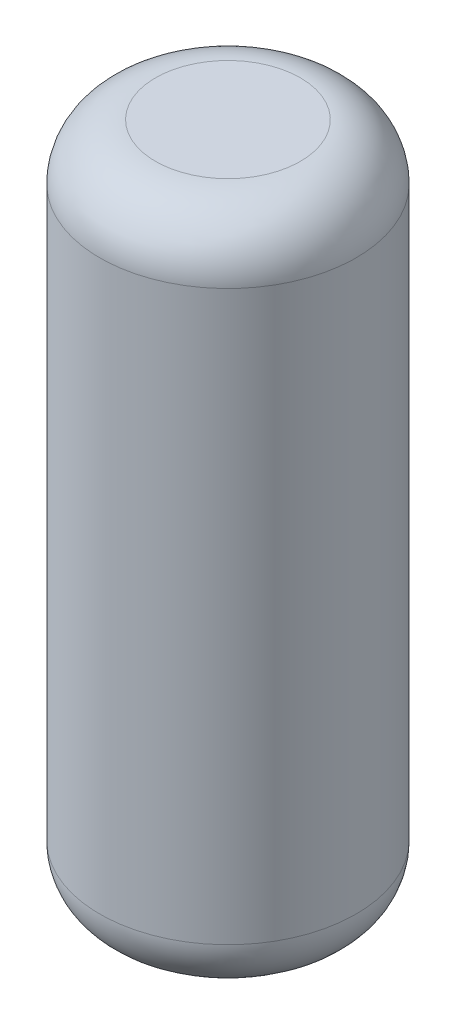
ISO-10303-21;
HEADER;
FILE_DESCRIPTION(('STEP AP214'),'2;1');
FILE_NAME('part.step','',(''),(''),'','','');
FILE_SCHEMA(('AUTOMOTIVE_DESIGN { 1 0 10303 214 1 1 1 1 }'));
ENDSEC;
DATA;
#1=APPLICATION_CONTEXT('core data for automotive mechanical design processes');
#2=APPLICATION_PROTOCOL_DEFINITION('international standard','automotive_design',2000,#1);
#3=PRODUCT_CONTEXT('',#1,'mechanical');
#4=PRODUCT('Part','Part','',(#3));
#5=PRODUCT_RELATED_PRODUCT_CATEGORY('part','',(#4));
#6=PRODUCT_DEFINITION_FORMATION('','',#4);
#7=PRODUCT_DEFINITION_CONTEXT('part definition',#1,'design');
#8=PRODUCT_DEFINITION('design','',#6,#7);
#9=PRODUCT_DEFINITION_SHAPE('','',#8);
#10=(LENGTH_UNIT() NAMED_UNIT(*) SI_UNIT(.MILLI.,.METRE.));
#11=(NAMED_UNIT(*) PLANE_ANGLE_UNIT() SI_UNIT($,.RADIAN.));
#12=(NAMED_UNIT(*) SI_UNIT($,.STERADIAN.) SOLID_ANGLE_UNIT());
#13=UNCERTAINTY_MEASURE_WITH_UNIT(LENGTH_MEASURE(1.E-05),#10,'distance_accuracy_value','');
#14=(GEOMETRIC_REPRESENTATION_CONTEXT(3) GLOBAL_UNCERTAINTY_ASSIGNED_CONTEXT((#13)) GLOBAL_UNIT_ASSIGNED_CONTEXT((#10,
#11,#12)) REPRESENTATION_CONTEXT('',''));
#15=CARTESIAN_POINT('',(0.,0.,0.));
#16=DIRECTION('',(0.,0.,1.));
#17=DIRECTION('',(1.,0.,0.));
#18=AXIS2_PLACEMENT_3D('',#15,#16,#17);
#19=CARTESIAN_POINT('',(0.,229.87,0.));
#20=DIRECTION('',(0.,1.,0.));
#21=DIRECTION('',(0.,0.,1.));
#22=AXIS2_PLACEMENT_3D('',#19,#20,#21);
#23=PLANE('',#22);
#24=CARTESIAN_POINT('',(0.,229.87,0.));
#25=DIRECTION('',(0.,-1.,0.));
#26=DIRECTION('',(0.,0.,-1.));
#27=AXIS2_PLACEMENT_3D('',#24,#25,#26);
#28=CIRCLE('',#27,49.5299999999998);
#29=CARTESIAN_POINT('',(0.,229.87,-49.5299999999998));
#30=VERTEX_POINT('',#29);
#31=EDGE_CURVE('E59',#30,#30,#28,.T.);
#32=ORIENTED_EDGE('',*,*,#31,.T.);
#33=EDGE_LOOP('',(#32));
#34=FACE_BOUND('',#33,.T.);
#35=ADVANCED_FACE('F36',(#34),#23,.F.);
#36=CARTESIAN_POINT('',(0.,194.31,0.));
#37=DIRECTION('',(0.,-1.,0.));
#38=DIRECTION('',(0.,0.,-1.));
#39=AXIS2_PLACEMENT_3D('',#36,#37,#38);
#40=TOROIDAL_SURFACE('',#39,49.53,35.56);
#41=ORIENTED_EDGE('',*,*,#31,.F.);
#42=EDGE_LOOP('',(#41));
#43=FACE_BOUND('',#42,.T.);
#44=CARTESIAN_POINT('',(0.,194.31,0.));
#45=DIRECTION('',(0.,-1.,0.));
#46=DIRECTION('',(0.,0.,-1.));
#47=AXIS2_PLACEMENT_3D('',#44,#45,#46);
#48=CIRCLE('',#47,85.09);
#49=CARTESIAN_POINT('',(0.,194.31,-85.09));
#50=VERTEX_POINT('',#49);
#51=EDGE_CURVE('E69',#50,#50,#48,.T.);
#52=ORIENTED_EDGE('',*,*,#51,.T.);
#53=EDGE_LOOP('',(#52));
#54=FACE_BOUND('',#53,.T.);
#55=ADVANCED_FACE('F112',(#43,#54),#40,.F.);
#56=CARTESIAN_POINT('',(0.,-232.41,0.));
#57=DIRECTION('',(0.,-1.,0.));
#58=DIRECTION('',(0.,0.,-1.));
#59=AXIS2_PLACEMENT_3D('',#56,#57,#58);
#60=CYLINDRICAL_SURFACE('',#59,85.09);
#61=ORIENTED_EDGE('',*,*,#51,.F.);
#62=EDGE_LOOP('',(#61));
#63=FACE_BOUND('',#62,.T.);
#64=CARTESIAN_POINT('',(0.,-194.31,0.));
#65=DIRECTION('',(0.,-1.,0.));
#66=DIRECTION('',(0.,0.,-1.));
#67=AXIS2_PLACEMENT_3D('',#64,#65,#66);
#68=CIRCLE('',#67,85.09);
#69=CARTESIAN_POINT('',(0.,-194.31,-85.09));
#70=VERTEX_POINT('',#69);
#71=EDGE_CURVE('E66',#70,#70,#68,.T.);
#72=ORIENTED_EDGE('',*,*,#71,.T.);
#73=EDGE_LOOP('',(#72));
#74=FACE_BOUND('',#73,.T.);
#75=ADVANCED_FACE('F118',(#63,#74),#60,.F.);
#76=CARTESIAN_POINT('',(0.,-194.31,0.));
#77=DIRECTION('',(0.,-1.,0.));
#78=DIRECTION('',(0.,0.,-1.));
#79=AXIS2_PLACEMENT_3D('',#76,#77,#78);
#80=TOROIDAL_SURFACE('',#79,49.53,35.56);
#81=ORIENTED_EDGE('',*,*,#71,.F.);
#82=EDGE_LOOP('',(#81));
#83=FACE_BOUND('',#82,.T.);
#84=CARTESIAN_POINT('',(0.,-229.87,0.));
#85=DIRECTION('',(0.,-1.,0.));
#86=DIRECTION('',(0.,0.,-1.));
#87=AXIS2_PLACEMENT_3D('',#84,#85,#86);
#88=CIRCLE('',#87,49.5299999999998);
#89=CARTESIAN_POINT('',(0.,-229.87,-49.5299999999998));
#90=VERTEX_POINT('',#89);
#91=EDGE_CURVE('E63',#90,#90,#88,.T.);
#92=ORIENTED_EDGE('',*,*,#91,.T.);
#93=EDGE_LOOP('',(#92));
#94=FACE_BOUND('',#93,.T.);
#95=ADVANCED_FACE('F125',(#83,#94),#80,.F.);
#96=CARTESIAN_POINT('',(0.,-229.87,0.));
#97=DIRECTION('',(0.,-1.,0.));
#98=DIRECTION('',(0.,0.,-1.));
#99=AXIS2_PLACEMENT_3D('',#96,#97,#98);
#100=PLANE('',#99);
#101=CARTESIAN_POINT('',(0.,-229.87,0.));
#102=DIRECTION('',(0.,-1.,0.));
#103=DIRECTION('',(0.,0.,-1.));
#104=AXIS2_PLACEMENT_3D('',#101,#102,#103);
#105=CIRCLE('',#104,10.16);
#106=CARTESIAN_POINT('',(0.,-229.87,10.16));
#107=VERTEX_POINT('',#106);
#108=EDGE_CURVE('E60',#107,#107,#105,.T.);
#109=ORIENTED_EDGE('',*,*,#108,.T.);
#110=EDGE_LOOP('',(#109));
#111=FACE_BOUND('',#110,.T.);
#112=ORIENTED_EDGE('',*,*,#91,.F.);
#113=EDGE_LOOP('',(#112));
#114=FACE_BOUND('',#113,.T.);
#115=ADVANCED_FACE('F129',(#111,#114),#100,.F.);
#116=CARTESIAN_POINT('',(0.,-251.46,0.));
#117=DIRECTION('',(0.,1.,0.));
#118=DIRECTION('',(0.,0.,1.));
#119=AXIS2_PLACEMENT_3D('',#116,#117,#118);
#120=CYLINDRICAL_SURFACE('',#119,10.16);
#121=CARTESIAN_POINT('',(0.,-232.41,0.));
#122=DIRECTION('',(0.,-1.,0.));
#123=DIRECTION('',(0.,0.,-1.));
#124=AXIS2_PLACEMENT_3D('',#121,#122,#123);
#125=CIRCLE('',#124,10.16);
#126=CARTESIAN_POINT('',(0.,-232.41,10.16));
#127=VERTEX_POINT('',#126);
#128=EDGE_CURVE('E40',#127,#127,#125,.T.);
#129=CARTESIAN_POINT('',(0.,-229.87,10.16));
#130=CARTESIAN_POINT('',(0.,-229.896458333333,10.16));
#131=CARTESIAN_POINT('',(0.,-229.922916666667,10.16));
#132=CARTESIAN_POINT('',(0.,-229.975833333333,10.16));
#133=CARTESIAN_POINT('',(0.,-230.002291666667,10.16));
#134=CARTESIAN_POINT('',(0.,-230.055208333333,10.16));
#135=CARTESIAN_POINT('',(0.,-230.081666666667,10.16));
#136=CARTESIAN_POINT('',(0.,-230.134583333333,10.16));
#137=CARTESIAN_POINT('',(0.,-230.161041666667,10.16));
#138=CARTESIAN_POINT('',(0.,-230.213958333333,10.16));
#139=CARTESIAN_POINT('',(0.,-230.240416666667,10.16));
#140=CARTESIAN_POINT('',(0.,-230.293333333333,10.16));
#141=CARTESIAN_POINT('',(0.,-230.319791666667,10.16));
#142=CARTESIAN_POINT('',(0.,-230.372708333333,10.16));
#143=CARTESIAN_POINT('',(0.,-230.399166666667,10.16));
#144=CARTESIAN_POINT('',(0.,-230.452083333333,10.16));
#145=CARTESIAN_POINT('',(0.,-230.478541666667,10.16));
#146=CARTESIAN_POINT('',(0.,-230.531458333333,10.16));
#147=CARTESIAN_POINT('',(0.,-230.557916666667,10.16));
#148=CARTESIAN_POINT('',(0.,-230.610833333333,10.16));
#149=CARTESIAN_POINT('',(0.,-230.637291666667,10.16));
#150=CARTESIAN_POINT('',(0.,-230.690208333333,10.16));
#151=CARTESIAN_POINT('',(0.,-230.716666666667,10.16));
#152=CARTESIAN_POINT('',(0.,-230.769583333333,10.16));
#153=CARTESIAN_POINT('',(0.,-230.796041666667,10.16));
#154=CARTESIAN_POINT('',(0.,-230.848958333333,10.16));
#155=CARTESIAN_POINT('',(0.,-230.875416666667,10.16));
#156=CARTESIAN_POINT('',(0.,-230.928333333333,10.16));
#157=CARTESIAN_POINT('',(0.,-230.954791666667,10.16));
#158=CARTESIAN_POINT('',(0.,-231.007708333333,10.16));
#159=CARTESIAN_POINT('',(0.,-231.034166666667,10.16));
#160=CARTESIAN_POINT('',(0.,-231.087083333333,10.16));
#161=CARTESIAN_POINT('',(0.,-231.113541666667,10.16));
#162=CARTESIAN_POINT('',(0.,-231.166458333333,10.16));
#163=CARTESIAN_POINT('',(0.,-231.192916666667,10.16));
#164=CARTESIAN_POINT('',(0.,-231.245833333333,10.16));
#165=CARTESIAN_POINT('',(0.,-231.272291666667,10.16));
#166=CARTESIAN_POINT('',(0.,-231.325208333333,10.16));
#167=CARTESIAN_POINT('',(0.,-231.351666666667,10.16));
#168=CARTESIAN_POINT('',(0.,-231.404583333333,10.16));
#169=CARTESIAN_POINT('',(0.,-231.431041666667,10.16));
#170=CARTESIAN_POINT('',(0.,-231.483958333333,10.16));
#171=CARTESIAN_POINT('',(0.,-231.510416666667,10.16));
#172=CARTESIAN_POINT('',(0.,-231.563333333333,10.16));
#173=CARTESIAN_POINT('',(0.,-231.589791666667,10.16));
#174=CARTESIAN_POINT('',(0.,-231.642708333333,10.16));
#175=CARTESIAN_POINT('',(0.,-231.669166666667,10.16));
#176=CARTESIAN_POINT('',(0.,-231.722083333333,10.16));
#177=CARTESIAN_POINT('',(0.,-231.748541666667,10.16));
#178=CARTESIAN_POINT('',(0.,-231.801458333333,10.16));
#179=CARTESIAN_POINT('',(0.,-231.827916666667,10.16));
#180=CARTESIAN_POINT('',(0.,-231.880833333333,10.16));
#181=CARTESIAN_POINT('',(0.,-231.907291666667,10.16));
#182=CARTESIAN_POINT('',(0.,-231.960208333333,10.16));
#183=CARTESIAN_POINT('',(0.,-231.986666666667,10.16));
#184=CARTESIAN_POINT('',(0.,-232.039583333333,10.16));
#185=CARTESIAN_POINT('',(0.,-232.066041666667,10.16));
#186=CARTESIAN_POINT('',(0.,-232.118958333333,10.16));
#187=CARTESIAN_POINT('',(0.,-232.145416666667,10.16));
#188=CARTESIAN_POINT('',(0.,-232.198333333333,10.16));
#189=CARTESIAN_POINT('',(0.,-232.224791666667,10.16));
#190=CARTESIAN_POINT('',(0.,-232.277708333333,10.16));
#191=CARTESIAN_POINT('',(0.,-232.304166666667,10.16));
#192=CARTESIAN_POINT('',(0.,-232.357083333333,10.16));
#193=CARTESIAN_POINT('',(0.,-232.383541666667,10.16));
#194=CARTESIAN_POINT('',(0.,-232.41,10.16));
#195=B_SPLINE_CURVE_WITH_KNOTS('',3,(#129,#130,#131,#132,#133,#134,#135,#136,#137,#138,#139,
#140,#141,#142,#143,#144,#145,#146,#147,#148,#149,#150,#151,#152,#153,#154,#155,#156,#157,#158,
#159,#160,#161,#162,#163,#164,#165,#166,#167,#168,#169,#170,#171,#172,#173,#174,#175,#176,#177,
#178,#179,#180,#181,#182,#183,#184,#185,#186,#187,#188,#189,#190,#191,#192,#193,#194),
.UNSPECIFIED.,.F.,.F.,(4,2,2,2,2,2,2,2,2,2,2,2,2,2,2,2,2,2,2,2,2,2,2,2,2,2,2,2,2,2,2,2,4),(0.,
0.0793750000000204,0.158750000000013,0.238125000000006,0.317499999999998,0.396875000000019,
0.476250000000011,0.555625000000004,0.635000000000024,0.714375000000017,0.79375000000001,
0.873125000000002,0.952500000000023,1.03187500000002,1.11125000000001,1.19062500000003,
1.27000000000002,1.34937500000001,1.42875000000003,1.50812500000003,1.58750000000002,
1.66687500000004,1.74625000000003,1.82562500000003,1.90500000000002,1.98437500000004,
2.06375000000003,2.14312500000002,2.22250000000004,2.30187500000004,2.38125000000003,
2.46062500000002,2.54000000000004),.UNSPECIFIED.);
#196=EDGE_CURVE('BSEAM132',#107,#127,#195,.T.);
#197=ORIENTED_EDGE('',*,*,#108,.F.);
#198=ORIENTED_EDGE('',*,*,#128,.T.);
#199=ORIENTED_EDGE('',*,*,#196,.T.);
#200=ORIENTED_EDGE('',*,*,#196,.F.);
#201=EDGE_LOOP('',(#197,#199,#198,#200));
#202=FACE_BOUND('',#201,.T.);
#203=ADVANCED_FACE('F132',(#202),#120,.F.);
#204=CARTESIAN_POINT('',(0.,-232.41,0.));
#205=DIRECTION('',(0.,-1.,0.));
#206=DIRECTION('',(0.,0.,-1.));
#207=AXIS2_PLACEMENT_3D('',#204,#205,#206);
#208=PLANE('',#207);
#209=CARTESIAN_POINT('',(0.,-232.41,0.));
#210=DIRECTION('',(0.,-1.,0.));
#211=DIRECTION('',(0.,0.,-1.));
#212=AXIS2_PLACEMENT_3D('',#209,#210,#211);
#213=CIRCLE('',#212,7.9375);
#214=CARTESIAN_POINT('',(0.,-232.41,-7.9375));
#215=VERTEX_POINT('',#214);
#216=EDGE_CURVE('E77',#215,#215,#213,.T.);
#217=ORIENTED_EDGE('',*,*,#216,.T.);
#218=EDGE_LOOP('',(#217));
#219=FACE_BOUND('',#218,.T.);
#220=ORIENTED_EDGE('',*,*,#128,.F.);
#221=EDGE_LOOP('',(#220));
#222=FACE_BOUND('',#221,.T.);
#223=ADVANCED_FACE('F84',(#219,#222),#208,.F.);
#224=CARTESIAN_POINT('',(0.,-232.41,0.));
#225=DIRECTION('',(0.,-1.,0.));
#226=DIRECTION('',(0.,0.,-1.));
#227=AXIS2_PLACEMENT_3D('',#224,#225,#226);
#228=CYLINDRICAL_SURFACE('',#227,7.9375);
#229=ORIENTED_EDGE('',*,*,#216,.F.);
#230=EDGE_LOOP('',(#229));
#231=FACE_BOUND('',#230,.T.);
#232=CARTESIAN_POINT('',(0.,-257.81,0.));
#233=DIRECTION('',(0.,-1.,0.));
#234=DIRECTION('',(0.,0.,-1.));
#235=AXIS2_PLACEMENT_3D('',#232,#233,#234);
#236=CIRCLE('',#235,7.9375);
#237=CARTESIAN_POINT('',(0.,-257.81,-7.9375));
#238=VERTEX_POINT('',#237);
#239=EDGE_CURVE('E78',#238,#238,#236,.T.);
#240=ORIENTED_EDGE('',*,*,#239,.T.);
#241=EDGE_LOOP('',(#240));
#242=FACE_BOUND('',#241,.T.);
#243=ADVANCED_FACE('F87',(#231,#242),#228,.F.);
#244=CARTESIAN_POINT('',(0.,232.41,0.));
#245=DIRECTION('',(0.,1.,0.));
#246=DIRECTION('',(0.,0.,1.));
#247=AXIS2_PLACEMENT_3D('',#244,#245,#246);
#248=PLANE('',#247);
#249=CARTESIAN_POINT('',(0.,232.41,0.));
#250=DIRECTION('',(0.,-1.,0.));
#251=DIRECTION('',(0.,0.,-1.));
#252=AXIS2_PLACEMENT_3D('',#249,#250,#251);
#253=CIRCLE('',#252,49.5299999999997);
#254=CARTESIAN_POINT('',(0.,232.41,-49.5299999999997));
#255=VERTEX_POINT('',#254);
#256=EDGE_CURVE('E10',#255,#255,#253,.T.);
#257=ORIENTED_EDGE('',*,*,#256,.F.);
#258=EDGE_LOOP('',(#257));
#259=FACE_BOUND('',#258,.T.);
#260=ADVANCED_FACE('F38',(#259),#248,.T.);
#261=CARTESIAN_POINT('',(0.,194.31,0.));
#262=DIRECTION('',(0.,-1.,0.));
#263=DIRECTION('',(0.,0.,-1.));
#264=AXIS2_PLACEMENT_3D('',#261,#262,#263);
#265=TOROIDAL_SURFACE('',#264,49.53,38.1);
#266=ORIENTED_EDGE('',*,*,#256,.T.);
#267=EDGE_LOOP('',(#266));
#268=FACE_BOUND('',#267,.T.);
#269=CARTESIAN_POINT('',(0.,194.31,0.));
#270=DIRECTION('',(0.,-1.,0.));
#271=DIRECTION('',(0.,0.,-1.));
#272=AXIS2_PLACEMENT_3D('',#269,#270,#271);
#273=CIRCLE('',#272,87.63);
#274=CARTESIAN_POINT('',(0.,194.31,-87.63));
#275=VERTEX_POINT('',#274);
#276=EDGE_CURVE('E44',#275,#275,#273,.T.);
#277=ORIENTED_EDGE('',*,*,#276,.F.);
#278=EDGE_LOOP('',(#277));
#279=FACE_BOUND('',#278,.T.);
#280=ADVANCED_FACE('F159',(#268,#279),#265,.T.);
#281=CARTESIAN_POINT('',(0.,-232.41,0.));
#282=DIRECTION('',(0.,-1.,0.));
#283=DIRECTION('',(0.,0.,-1.));
#284=AXIS2_PLACEMENT_3D('',#281,#282,#283);
#285=CYLINDRICAL_SURFACE('',#284,87.63);
#286=ORIENTED_EDGE('',*,*,#276,.T.);
#287=EDGE_LOOP('',(#286));
#288=FACE_BOUND('',#287,.T.);
#289=CARTESIAN_POINT('',(0.,-194.31,0.));
#290=DIRECTION('',(0.,-1.,0.));
#291=DIRECTION('',(0.,0.,-1.));
#292=AXIS2_PLACEMENT_3D('',#289,#290,#291);
#293=CIRCLE('',#292,87.63);
#294=CARTESIAN_POINT('',(0.,-194.31,-87.63));
#295=VERTEX_POINT('',#294);
#296=EDGE_CURVE('E48',#295,#295,#293,.T.);
#297=ORIENTED_EDGE('',*,*,#296,.F.);
#298=EDGE_LOOP('',(#297));
#299=FACE_BOUND('',#298,.T.);
#300=ADVANCED_FACE('F166',(#288,#299),#285,.T.);
#301=CARTESIAN_POINT('',(0.,-194.31,0.));
#302=DIRECTION('',(0.,-1.,0.));
#303=DIRECTION('',(0.,0.,-1.));
#304=AXIS2_PLACEMENT_3D('',#301,#302,#303);
#305=TOROIDAL_SURFACE('',#304,49.53,38.1);
#306=ORIENTED_EDGE('',*,*,#296,.T.);
#307=EDGE_LOOP('',(#306));
#308=FACE_BOUND('',#307,.T.);
#309=CARTESIAN_POINT('',(0.,-232.41,0.));
#310=DIRECTION('',(0.,-1.,0.));
#311=DIRECTION('',(0.,0.,-1.));
#312=AXIS2_PLACEMENT_3D('',#309,#310,#311);
#313=CIRCLE('',#312,49.5299999999998);
#314=CARTESIAN_POINT('',(0.,-232.41,-49.5299999999998));
#315=VERTEX_POINT('',#314);
#316=EDGE_CURVE('E53',#315,#315,#313,.T.);
#317=ORIENTED_EDGE('',*,*,#316,.F.);
#318=EDGE_LOOP('',(#317));
#319=FACE_BOUND('',#318,.T.);
#320=ADVANCED_FACE('F107',(#308,#319),#305,.T.);
#321=CARTESIAN_POINT('',(0.,-232.41,0.));
#322=DIRECTION('',(0.,-1.,0.));
#323=DIRECTION('',(0.,0.,-1.));
#324=AXIS2_PLACEMENT_3D('',#321,#322,#323);
#325=PLANE('',#324);
#326=CARTESIAN_POINT('',(0.,-232.41,0.));
#327=DIRECTION('',(0.,-1.,0.));
#328=DIRECTION('',(0.,0.,-1.));
#329=AXIS2_PLACEMENT_3D('',#326,#327,#328);
#330=CIRCLE('',#329,12.7);
#331=CARTESIAN_POINT('',(0.,-232.41,12.7));
#332=VERTEX_POINT('',#331);
#333=EDGE_CURVE('E56',#332,#332,#330,.T.);
#334=ORIENTED_EDGE('',*,*,#333,.F.);
#335=EDGE_LOOP('',(#334));
#336=FACE_BOUND('',#335,.T.);
#337=ORIENTED_EDGE('',*,*,#316,.T.);
#338=EDGE_LOOP('',(#337));
#339=FACE_BOUND('',#338,.T.);
#340=ADVANCED_FACE('F101',(#336,#339),#325,.T.);
#341=CARTESIAN_POINT('',(0.,-251.46,0.));
#342=DIRECTION('',(0.,1.,0.));
#343=DIRECTION('',(0.,0.,1.));
#344=AXIS2_PLACEMENT_3D('',#341,#342,#343);
#345=CYLINDRICAL_SURFACE('',#344,12.7);
#346=CARTESIAN_POINT('',(0.,-257.81,0.));
#347=DIRECTION('',(0.,-1.,0.));
#348=DIRECTION('',(0.,0.,-1.));
#349=AXIS2_PLACEMENT_3D('',#346,#347,#348);
#350=CIRCLE('',#349,12.7);
#351=CARTESIAN_POINT('',(0.,-257.81,12.7));
#352=VERTEX_POINT('',#351);
#353=EDGE_CURVE('E74',#352,#352,#350,.T.);
#354=CARTESIAN_POINT('',(0.,-232.41,12.7));
#355=CARTESIAN_POINT('',(0.,-232.674583333333,12.7));
#356=CARTESIAN_POINT('',(0.,-232.939166666667,12.7));
#357=CARTESIAN_POINT('',(0.,-233.468333333333,12.7));
#358=CARTESIAN_POINT('',(0.,-233.732916666667,12.7));
#359=CARTESIAN_POINT('',(0.,-234.262083333333,12.7));
#360=CARTESIAN_POINT('',(0.,-234.526666666667,12.7));
#361=CARTESIAN_POINT('',(0.,-235.055833333333,12.7));
#362=CARTESIAN_POINT('',(0.,-235.320416666667,12.7));
#363=CARTESIAN_POINT('',(0.,-235.849583333333,12.7));
#364=CARTESIAN_POINT('',(0.,-236.114166666667,12.7));
#365=CARTESIAN_POINT('',(0.,-236.643333333333,12.7));
#366=CARTESIAN_POINT('',(0.,-236.907916666667,12.7));
#367=CARTESIAN_POINT('',(0.,-237.437083333333,12.7));
#368=CARTESIAN_POINT('',(0.,-237.701666666667,12.7));
#369=CARTESIAN_POINT('',(0.,-238.230833333333,12.7));
#370=CARTESIAN_POINT('',(0.,-238.495416666667,12.7));
#371=CARTESIAN_POINT('',(0.,-239.024583333333,12.7));
#372=CARTESIAN_POINT('',(0.,-239.289166666667,12.7));
#373=CARTESIAN_POINT('',(0.,-239.818333333333,12.7));
#374=CARTESIAN_POINT('',(0.,-240.082916666667,12.7));
#375=CARTESIAN_POINT('',(0.,-240.612083333333,12.7));
#376=CARTESIAN_POINT('',(0.,-240.876666666667,12.7));
#377=CARTESIAN_POINT('',(0.,-241.405833333333,12.7));
#378=CARTESIAN_POINT('',(0.,-241.670416666667,12.7));
#379=CARTESIAN_POINT('',(0.,-242.199583333333,12.7));
#380=CARTESIAN_POINT('',(0.,-242.464166666667,12.7));
#381=CARTESIAN_POINT('',(0.,-242.993333333333,12.7));
#382=CARTESIAN_POINT('',(0.,-243.257916666667,12.7));
#383=CARTESIAN_POINT('',(0.,-243.787083333333,12.7));
#384=CARTESIAN_POINT('',(0.,-244.051666666667,12.7));
#385=CARTESIAN_POINT('',(0.,-244.580833333333,12.7));
#386=CARTESIAN_POINT('',(0.,-244.845416666667,12.7));
#387=CARTESIAN_POINT('',(0.,-245.374583333333,12.7));
#388=CARTESIAN_POINT('',(0.,-245.639166666667,12.7));
#389=CARTESIAN_POINT('',(0.,-246.168333333333,12.7));
#390=CARTESIAN_POINT('',(0.,-246.432916666667,12.7));
#391=CARTESIAN_POINT('',(0.,-246.962083333333,12.7));
#392=CARTESIAN_POINT('',(0.,-247.226666666667,12.7));
#393=CARTESIAN_POINT('',(0.,-247.755833333333,12.7));
#394=CARTESIAN_POINT('',(0.,-248.020416666667,12.7));
#395=CARTESIAN_POINT('',(0.,-248.549583333333,12.7));
#396=CARTESIAN_POINT('',(0.,-248.814166666667,12.7));
#397=CARTESIAN_POINT('',(0.,-249.343333333333,12.7));
#398=CARTESIAN_POINT('',(0.,-249.607916666667,12.7));
#399=CARTESIAN_POINT('',(0.,-250.137083333333,12.7));
#400=CARTESIAN_POINT('',(0.,-250.401666666667,12.7));
#401=CARTESIAN_POINT('',(0.,-250.930833333333,12.7));
#402=CARTESIAN_POINT('',(0.,-251.195416666667,12.7));
#403=CARTESIAN_POINT('',(0.,-251.724583333333,12.7));
#404=CARTESIAN_POINT('',(0.,-251.989166666667,12.7));
#405=CARTESIAN_POINT('',(0.,-252.518333333333,12.7));
#406=CARTESIAN_POINT('',(0.,-252.782916666667,12.7));
#407=CARTESIAN_POINT('',(0.,-253.312083333333,12.7));
#408=CARTESIAN_POINT('',(0.,-253.576666666667,12.7));
#409=CARTESIAN_POINT('',(0.,-254.105833333333,12.7));
#410=CARTESIAN_POINT('',(0.,-254.370416666667,12.7));
#411=CARTESIAN_POINT('',(0.,-254.899583333333,12.7));
#412=CARTESIAN_POINT('',(0.,-255.164166666667,12.7));
#413=CARTESIAN_POINT('',(0.,-255.693333333333,12.7));
#414=CARTESIAN_POINT('',(0.,-255.957916666667,12.7));
#415=CARTESIAN_POINT('',(0.,-256.487083333333,12.7));
#416=CARTESIAN_POINT('',(0.,-256.751666666667,12.7));
#417=CARTESIAN_POINT('',(0.,-257.280833333333,12.7));
#418=CARTESIAN_POINT('',(0.,-257.545416666667,12.7));
#419=CARTESIAN_POINT('',(0.,-257.81,12.7));
#420=B_SPLINE_CURVE_WITH_KNOTS('',3,(#354,#355,#356,#357,#358,#359,#360,#361,#362,#363,#364,
#365,#366,#367,#368,#369,#370,#371,#372,#373,#374,#375,#376,#377,#378,#379,#380,#381,#382,#383,
#384,#385,#386,#387,#388,#389,#390,#391,#392,#393,#394,#395,#396,#397,#398,#399,#400,#401,#402,
#403,#404,#405,#406,#407,#408,#409,#410,#411,#412,#413,#414,#415,#416,#417,#418,#419),
.UNSPECIFIED.,.F.,.F.,(4,2,2,2,2,2,2,2,2,2,2,2,2,2,2,2,2,2,2,2,2,2,2,2,2,2,2,2,2,2,2,2,4),(0.,
0.79375000000001,1.58750000000002,2.38125,3.17500000000001,3.96875000000002,4.7625,
5.55625000000001,6.35000000000002,7.14375,7.93750000000001,8.73125000000002,9.52500000000001,
10.31875,11.1125,11.90625,12.7,13.49375,14.2875,15.08125,15.875,16.66875,17.4625,18.25625,19.05,
19.84375,20.6375,21.43125,22.225,23.01875,23.8125,24.60625,25.4),.UNSPECIFIED.);
#421=EDGE_CURVE('BSEAM96',#332,#352,#420,.T.);
#422=ORIENTED_EDGE('',*,*,#333,.T.);
#423=ORIENTED_EDGE('',*,*,#353,.F.);
#424=ORIENTED_EDGE('',*,*,#421,.T.);
#425=ORIENTED_EDGE('',*,*,#421,.F.);
#426=EDGE_LOOP('',(#422,#424,#423,#425));
#427=FACE_BOUND('',#426,.T.);
#428=ADVANCED_FACE('F96',(#427),#345,.T.);
#429=CARTESIAN_POINT('',(0.,-257.81,0.));
#430=DIRECTION('',(0.,-1.,0.));
#431=DIRECTION('',(0.,0.,-1.));
#432=AXIS2_PLACEMENT_3D('',#429,#430,#431);
#433=PLANE('',#432);
#434=ORIENTED_EDGE('',*,*,#239,.F.);
#435=EDGE_LOOP('',(#434));
#436=FACE_BOUND('',#435,.T.);
#437=ORIENTED_EDGE('',*,*,#353,.T.);
#438=EDGE_LOOP('',(#437));
#439=FACE_BOUND('',#438,.T.);
#440=ADVANCED_FACE('F93',(#436,#439),#433,.T.);
#441=CLOSED_SHELL('',(#35,#55,#75,#95,#115,#203,#223,#243,#260,#280,#300,#320,#340,#428,#440));
#442=MANIFOLD_SOLID_BREP('B2',#441);
#443=ADVANCED_BREP_SHAPE_REPRESENTATION('',(#18,#442),#14);
#444=SHAPE_DEFINITION_REPRESENTATION(#9,#443);
ENDSEC;
END-ISO-10303-21;
